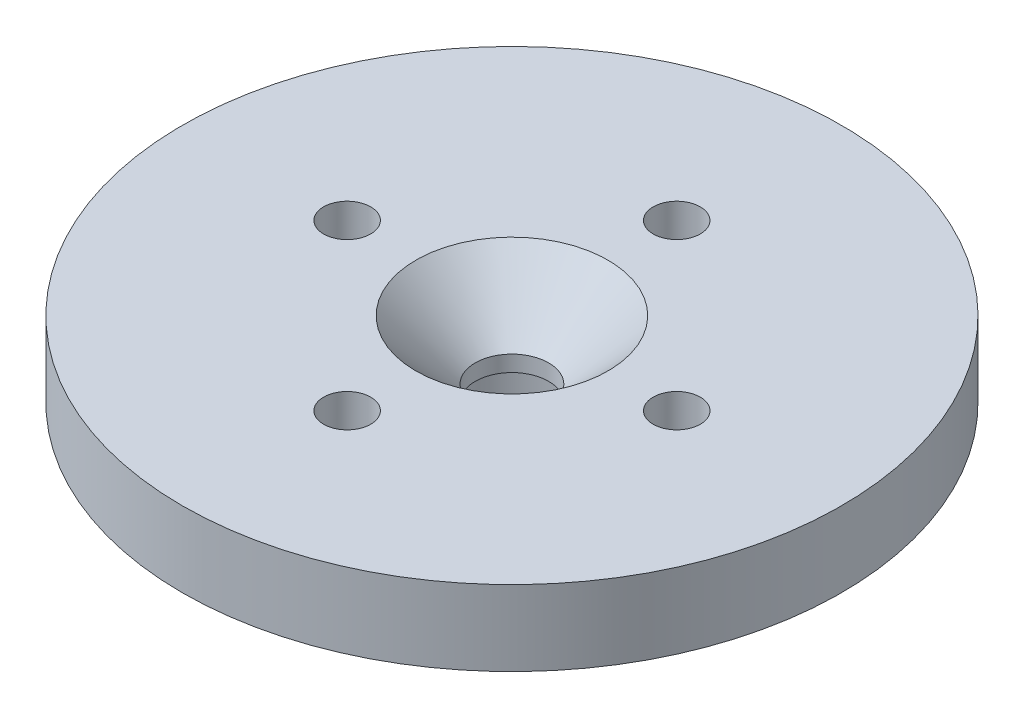
ISO-10303-21;
HEADER;
FILE_DESCRIPTION(('STEP AP214'),'2;1');
FILE_NAME('part.step','',(''),(''),'','','');
FILE_SCHEMA(('AUTOMOTIVE_DESIGN { 1 0 10303 214 1 1 1 1 }'));
ENDSEC;
DATA;
#1=APPLICATION_CONTEXT('core data for automotive mechanical design processes');
#2=APPLICATION_PROTOCOL_DEFINITION('international standard','automotive_design',2000,#1);
#3=PRODUCT_CONTEXT('',#1,'mechanical');
#4=PRODUCT('Part','Part','',(#3));
#5=PRODUCT_RELATED_PRODUCT_CATEGORY('part','',(#4));
#6=PRODUCT_DEFINITION_FORMATION('','',#4);
#7=PRODUCT_DEFINITION_CONTEXT('part definition',#1,'design');
#8=PRODUCT_DEFINITION('design','',#6,#7);
#9=PRODUCT_DEFINITION_SHAPE('','',#8);
#10=(LENGTH_UNIT() NAMED_UNIT(*) SI_UNIT(.MILLI.,.METRE.));
#11=(NAMED_UNIT(*) PLANE_ANGLE_UNIT() SI_UNIT($,.RADIAN.));
#12=(NAMED_UNIT(*) SI_UNIT($,.STERADIAN.) SOLID_ANGLE_UNIT());
#13=UNCERTAINTY_MEASURE_WITH_UNIT(LENGTH_MEASURE(1.E-05),#10,'distance_accuracy_value','');
#14=(GEOMETRIC_REPRESENTATION_CONTEXT(3) GLOBAL_UNCERTAINTY_ASSIGNED_CONTEXT((#13)) GLOBAL_UNIT_ASSIGNED_CONTEXT((#10,
#11,#12)) REPRESENTATION_CONTEXT('',''));
#15=CARTESIAN_POINT('',(0.,0.,0.));
#16=DIRECTION('',(0.,0.,1.));
#17=DIRECTION('',(1.,0.,0.));
#18=AXIS2_PLACEMENT_3D('',#15,#16,#17);
#19=CARTESIAN_POINT('',(0.,0.,0.));
#20=DIRECTION('',(0.,1.,0.));
#21=DIRECTION('',(0.,0.,1.));
#22=AXIS2_PLACEMENT_3D('',#19,#20,#21);
#23=PLANE('',#22);
#24=CARTESIAN_POINT('',(0.,0.,-8.75));
#25=DIRECTION('',(0.,-1.,0.));
#26=DIRECTION('',(0.,0.,-1.));
#27=AXIS2_PLACEMENT_3D('',#24,#25,#26);
#28=CIRCLE('',#27,1.25);
#29=CARTESIAN_POINT('',(0.,0.,-10.));
#30=VERTEX_POINT('',#29);
#31=EDGE_CURVE('E74',#30,#30,#28,.T.);
#32=ORIENTED_EDGE('',*,*,#31,.F.);
#33=EDGE_LOOP('',(#32));
#34=FACE_BOUND('',#33,.T.);
#35=CARTESIAN_POINT('',(0.,0.,8.75));
#36=DIRECTION('',(0.,-1.,0.));
#37=DIRECTION('',(0.,0.,-1.));
#38=AXIS2_PLACEMENT_3D('',#35,#36,#37);
#39=CIRCLE('',#38,1.25);
#40=CARTESIAN_POINT('',(0.,0.,7.5));
#41=VERTEX_POINT('',#40);
#42=EDGE_CURVE('E64',#41,#41,#39,.T.);
#43=ORIENTED_EDGE('',*,*,#42,.F.);
#44=EDGE_LOOP('',(#43));
#45=FACE_BOUND('',#44,.T.);
#46=CARTESIAN_POINT('',(8.75,0.,0.));
#47=DIRECTION('',(0.,-1.,0.));
#48=DIRECTION('',(0.,0.,-1.));
#49=AXIS2_PLACEMENT_3D('',#46,#47,#48);
#50=CIRCLE('',#49,1.25);
#51=CARTESIAN_POINT('',(8.75,0.,-1.25));
#52=VERTEX_POINT('',#51);
#53=EDGE_CURVE('E57',#52,#52,#50,.T.);
#54=ORIENTED_EDGE('',*,*,#53,.F.);
#55=EDGE_LOOP('',(#54));
#56=FACE_BOUND('',#55,.T.);
#57=CARTESIAN_POINT('',(-8.75,0.,0.));
#58=DIRECTION('',(0.,-1.,0.));
#59=DIRECTION('',(0.,0.,-1.));
#60=AXIS2_PLACEMENT_3D('',#57,#58,#59);
#61=CIRCLE('',#60,1.25);
#62=CARTESIAN_POINT('',(-8.75,0.,-1.25));
#63=VERTEX_POINT('',#62);
#64=EDGE_CURVE('E53',#63,#63,#61,.T.);
#65=ORIENTED_EDGE('',*,*,#64,.F.);
#66=EDGE_LOOP('',(#65));
#67=FACE_BOUND('',#66,.T.);
#68=CARTESIAN_POINT('',(0.,0.,0.));
#69=DIRECTION('',(0.,1.,0.));
#70=DIRECTION('',(0.,0.,1.));
#71=AXIS2_PLACEMENT_3D('',#68,#69,#70);
#72=CIRCLE('',#71,17.5);
#73=CARTESIAN_POINT('',(0.,0.,17.5));
#74=VERTEX_POINT('',#73);
#75=EDGE_CURVE('E45',#74,#74,#72,.T.);
#76=ORIENTED_EDGE('',*,*,#75,.F.);
#77=EDGE_LOOP('',(#76));
#78=FACE_BOUND('',#77,.T.);
#79=CARTESIAN_POINT('',(0.,0.,0.));
#80=DIRECTION('',(0.,1.,0.));
#81=DIRECTION('',(0.,0.,1.));
#82=AXIS2_PLACEMENT_3D('',#79,#80,#81);
#83=CIRCLE('',#82,5.);
#84=CARTESIAN_POINT('',(0.,0.,5.));
#85=VERTEX_POINT('',#84);
#86=EDGE_CURVE('E10',#85,#85,#83,.F.);
#87=ORIENTED_EDGE('',*,*,#86,.F.);
#88=EDGE_LOOP('',(#87));
#89=FACE_BOUND('',#88,.T.);
#90=ADVANCED_FACE('F32',(#34,#45,#56,#67,#78,#89),#23,.F.);
#91=CARTESIAN_POINT('',(0.,4.,0.));
#92=DIRECTION('',(0.,-1.,0.));
#93=DIRECTION('',(0.,0.,-1.));
#94=AXIS2_PLACEMENT_3D('',#91,#92,#93);
#95=CYLINDRICAL_SURFACE('',#94,17.5);
#96=CARTESIAN_POINT('',(0.,4.,0.));
#97=DIRECTION('',(0.,1.,0.));
#98=DIRECTION('',(0.,0.,1.));
#99=AXIS2_PLACEMENT_3D('',#96,#97,#98);
#100=CIRCLE('',#99,17.5);
#101=CARTESIAN_POINT('',(0.,4.,17.5));
#102=VERTEX_POINT('',#101);
#103=EDGE_CURVE('E40',#102,#102,#100,.T.);
#104=ORIENTED_EDGE('',*,*,#103,.F.);
#105=EDGE_LOOP('',(#104));
#106=FACE_BOUND('',#105,.T.);
#107=ORIENTED_EDGE('',*,*,#75,.T.);
#108=EDGE_LOOP('',(#107));
#109=FACE_BOUND('',#108,.T.);
#110=ADVANCED_FACE('F34',(#106,#109),#95,.T.);
#111=CARTESIAN_POINT('',(0.,4.,0.));
#112=DIRECTION('',(0.,1.,0.));
#113=DIRECTION('',(0.,0.,1.));
#114=AXIS2_PLACEMENT_3D('',#111,#112,#113);
#115=PLANE('',#114);
#116=CARTESIAN_POINT('',(0.,4.,-8.75));
#117=DIRECTION('',(0.,1.,0.));
#118=DIRECTION('',(0.,0.,1.));
#119=AXIS2_PLACEMENT_3D('',#116,#117,#118);
#120=CIRCLE('',#119,1.25);
#121=CARTESIAN_POINT('',(0.,4.,-7.5));
#122=VERTEX_POINT('',#121);
#123=EDGE_CURVE('E36',#122,#122,#120,.T.);
#124=ORIENTED_EDGE('',*,*,#123,.F.);
#125=EDGE_LOOP('',(#124));
#126=FACE_BOUND('',#125,.T.);
#127=CARTESIAN_POINT('',(0.,4.,8.75));
#128=DIRECTION('',(0.,1.,0.));
#129=DIRECTION('',(0.,0.,1.));
#130=AXIS2_PLACEMENT_3D('',#127,#128,#129);
#131=CIRCLE('',#130,1.25);
#132=CARTESIAN_POINT('',(0.,4.,10.));
#133=VERTEX_POINT('',#132);
#134=EDGE_CURVE('E61',#133,#133,#131,.T.);
#135=ORIENTED_EDGE('',*,*,#134,.F.);
#136=EDGE_LOOP('',(#135));
#137=FACE_BOUND('',#136,.T.);
#138=CARTESIAN_POINT('',(0.,4.,0.));
#139=DIRECTION('',(0.,1.,0.));
#140=DIRECTION('',(0.,0.,1.));
#141=AXIS2_PLACEMENT_3D('',#138,#139,#140);
#142=CIRCLE('',#141,5.1);
#143=CARTESIAN_POINT('',(0.,4.,5.1));
#144=VERTEX_POINT('',#143);
#145=EDGE_CURVE('E63',#144,#144,#142,.T.);
#146=ORIENTED_EDGE('',*,*,#145,.F.);
#147=EDGE_LOOP('',(#146));
#148=FACE_BOUND('',#147,.T.);
#149=CARTESIAN_POINT('',(8.75,4.,0.));
#150=DIRECTION('',(0.,1.,0.));
#151=DIRECTION('',(0.,0.,1.));
#152=AXIS2_PLACEMENT_3D('',#149,#150,#151);
#153=CIRCLE('',#152,1.25);
#154=CARTESIAN_POINT('',(8.75,4.,1.25));
#155=VERTEX_POINT('',#154);
#156=EDGE_CURVE('E54',#155,#155,#153,.T.);
#157=ORIENTED_EDGE('',*,*,#156,.F.);
#158=EDGE_LOOP('',(#157));
#159=FACE_BOUND('',#158,.T.);
#160=CARTESIAN_POINT('',(-8.75,4.,0.));
#161=DIRECTION('',(0.,1.,0.));
#162=DIRECTION('',(0.,0.,1.));
#163=AXIS2_PLACEMENT_3D('',#160,#161,#162);
#164=CIRCLE('',#163,1.25);
#165=CARTESIAN_POINT('',(-8.75,4.,1.25));
#166=VERTEX_POINT('',#165);
#167=EDGE_CURVE('E49',#166,#166,#164,.T.);
#168=ORIENTED_EDGE('',*,*,#167,.F.);
#169=EDGE_LOOP('',(#168));
#170=FACE_BOUND('',#169,.T.);
#171=ORIENTED_EDGE('',*,*,#103,.T.);
#172=EDGE_LOOP('',(#171));
#173=FACE_BOUND('',#172,.T.);
#174=ADVANCED_FACE('F103',(#126,#137,#148,#159,#170,#173),#115,.T.);
#175=CARTESIAN_POINT('',(0.,-6.9,0.));
#176=DIRECTION('',(0.,-1.,0.));
#177=DIRECTION('',(0.,0.,-1.));
#178=AXIS2_PLACEMENT_3D('',#175,#176,#177);
#179=PLANE('',#178);
#180=CARTESIAN_POINT('',(0.,-6.9,0.));
#181=DIRECTION('',(0.,-1.,0.));
#182=DIRECTION('',(0.,0.,-1.));
#183=AXIS2_PLACEMENT_3D('',#180,#181,#182);
#184=CIRCLE('',#183,5.);
#185=CARTESIAN_POINT('',(0.,-6.9,-5.));
#186=VERTEX_POINT('',#185);
#187=EDGE_CURVE('E86',#186,#186,#184,.T.);
#188=ORIENTED_EDGE('',*,*,#187,.T.);
#189=EDGE_LOOP('',(#188));
#190=FACE_BOUND('',#189,.T.);
#191=CARTESIAN_POINT('',(0.,-6.9,0.));
#192=DIRECTION('',(0.,-1.,0.));
#193=DIRECTION('',(0.,0.,-1.));
#194=AXIS2_PLACEMENT_3D('',#191,#192,#193);
#195=CIRCLE('',#194,4.);
#196=CARTESIAN_POINT('',(0.,-6.9,-4.));
#197=VERTEX_POINT('',#196);
#198=EDGE_CURVE('E83',#197,#197,#195,.T.);
#199=ORIENTED_EDGE('',*,*,#198,.F.);
#200=EDGE_LOOP('',(#199));
#201=FACE_BOUND('',#200,.T.);
#202=ADVANCED_FACE('F143',(#190,#201),#179,.T.);
#203=CARTESIAN_POINT('',(0.,-6.9,0.));
#204=DIRECTION('',(0.,1.,0.));
#205=DIRECTION('',(0.,0.,1.));
#206=AXIS2_PLACEMENT_3D('',#203,#204,#205);
#207=CYLINDRICAL_SURFACE('',#206,5.);
#208=ORIENTED_EDGE('',*,*,#187,.F.);
#209=EDGE_LOOP('',(#208));
#210=FACE_BOUND('',#209,.T.);
#211=ORIENTED_EDGE('',*,*,#86,.T.);
#212=EDGE_LOOP('',(#211));
#213=FACE_BOUND('',#212,.T.);
#214=ADVANCED_FACE('F119',(#210,#213),#207,.T.);
#215=CARTESIAN_POINT('',(0.,-6.9,0.));
#216=DIRECTION('',(0.,1.,0.));
#217=DIRECTION('',(0.,0.,1.));
#218=AXIS2_PLACEMENT_3D('',#215,#216,#217);
#219=CYLINDRICAL_SURFACE('',#218,4.);
#220=ORIENTED_EDGE('',*,*,#198,.T.);
#221=EDGE_LOOP('',(#220));
#222=FACE_BOUND('',#221,.T.);
#223=CARTESIAN_POINT('',(0.,0.,0.));
#224=DIRECTION('',(0.,-1.,0.));
#225=DIRECTION('',(0.,0.,-1.));
#226=AXIS2_PLACEMENT_3D('',#223,#224,#225);
#227=CIRCLE('',#226,4.);
#228=CARTESIAN_POINT('',(0.,0.,-4.));
#229=VERTEX_POINT('',#228);
#230=EDGE_CURVE('E52',#229,#229,#227,.T.);
#231=ORIENTED_EDGE('',*,*,#230,.F.);
#232=EDGE_LOOP('',(#231));
#233=FACE_BOUND('',#232,.T.);
#234=ADVANCED_FACE('F110',(#222,#233),#219,.F.);
#235=CARTESIAN_POINT('',(0.,0.,0.));
#236=DIRECTION('',(0.,1.,0.));
#237=DIRECTION('',(0.,0.,1.));
#238=AXIS2_PLACEMENT_3D('',#235,#236,#237);
#239=CIRCLE('',#238,1.95);
#240=CARTESIAN_POINT('',(0.,0.,1.95));
#241=VERTEX_POINT('',#240);
#242=EDGE_CURVE('E58',#241,#241,#239,.T.);
#243=ORIENTED_EDGE('',*,*,#242,.T.);
#244=EDGE_LOOP('',(#243));
#245=FACE_BOUND('',#244,.T.);
#246=ORIENTED_EDGE('',*,*,#230,.T.);
#247=EDGE_LOOP('',(#246));
#248=FACE_BOUND('',#247,.T.);
#249=ADVANCED_FACE('F99',(#245,#248),#23,.F.);
#250=CARTESIAN_POINT('',(-8.75,6.9,0.));
#251=DIRECTION('',(0.,-1.,0.));
#252=DIRECTION('',(0.,0.,-1.));
#253=AXIS2_PLACEMENT_3D('',#250,#251,#252);
#254=CYLINDRICAL_SURFACE('',#253,1.25);
#255=ORIENTED_EDGE('',*,*,#167,.T.);
#256=EDGE_LOOP('',(#255));
#257=FACE_BOUND('',#256,.T.);
#258=ORIENTED_EDGE('',*,*,#64,.T.);
#259=EDGE_LOOP('',(#258));
#260=FACE_BOUND('',#259,.T.);
#261=ADVANCED_FACE('F109',(#257,#260),#254,.F.);
#262=CARTESIAN_POINT('',(8.75,6.9,0.));
#263=DIRECTION('',(0.,-1.,0.));
#264=DIRECTION('',(0.,0.,-1.));
#265=AXIS2_PLACEMENT_3D('',#262,#263,#264);
#266=CYLINDRICAL_SURFACE('',#265,1.25);
#267=ORIENTED_EDGE('',*,*,#156,.T.);
#268=EDGE_LOOP('',(#267));
#269=FACE_BOUND('',#268,.T.);
#270=ORIENTED_EDGE('',*,*,#53,.T.);
#271=EDGE_LOOP('',(#270));
#272=FACE_BOUND('',#271,.T.);
#273=ADVANCED_FACE('F116',(#269,#272),#266,.F.);
#274=CARTESIAN_POINT('',(0.,4.,0.));
#275=DIRECTION('',(0.,1.,0.));
#276=DIRECTION('',(0.,0.,1.));
#277=AXIS2_PLACEMENT_3D('',#274,#275,#276);
#278=CYLINDRICAL_SURFACE('',#277,1.95);
#279=CARTESIAN_POINT('',(0.,0.85,0.));
#280=DIRECTION('',(0.,1.,0.));
#281=DIRECTION('',(0.,0.,1.));
#282=AXIS2_PLACEMENT_3D('',#279,#280,#281);
#283=CIRCLE('',#282,1.95);
#284=CARTESIAN_POINT('',(0.,0.85,1.95));
#285=VERTEX_POINT('',#284);
#286=EDGE_CURVE('E60',#285,#285,#283,.T.);
#287=ORIENTED_EDGE('',*,*,#286,.T.);
#288=EDGE_LOOP('',(#287));
#289=FACE_BOUND('',#288,.T.);
#290=ORIENTED_EDGE('',*,*,#242,.F.);
#291=EDGE_LOOP('',(#290));
#292=FACE_BOUND('',#291,.T.);
#293=ADVANCED_FACE('F127',(#289,#292),#278,.F.);
#294=CARTESIAN_POINT('',(0.,4.,0.));
#295=DIRECTION('',(0.,1.,0.));
#296=DIRECTION('',(0.,0.,1.));
#297=AXIS2_PLACEMENT_3D('',#294,#295,#296);
#298=CONICAL_SURFACE('',#297,5.1,0.785398163397449);
#299=ORIENTED_EDGE('',*,*,#286,.F.);
#300=EDGE_LOOP('',(#299));
#301=FACE_BOUND('',#300,.T.);
#302=ORIENTED_EDGE('',*,*,#145,.T.);
#303=EDGE_LOOP('',(#302));
#304=FACE_BOUND('',#303,.T.);
#305=ADVANCED_FACE('F129',(#301,#304),#298,.F.);
#306=CARTESIAN_POINT('',(0.,6.9,8.75));
#307=DIRECTION('',(0.,-1.,0.));
#308=DIRECTION('',(0.,0.,-1.));
#309=AXIS2_PLACEMENT_3D('',#306,#307,#308);
#310=CYLINDRICAL_SURFACE('',#309,1.25);
#311=ORIENTED_EDGE('',*,*,#134,.T.);
#312=EDGE_LOOP('',(#311));
#313=FACE_BOUND('',#312,.T.);
#314=ORIENTED_EDGE('',*,*,#42,.T.);
#315=EDGE_LOOP('',(#314));
#316=FACE_BOUND('',#315,.T.);
#317=ADVANCED_FACE('F136',(#313,#316),#310,.F.);
#318=CARTESIAN_POINT('',(0.,6.9,-8.75));
#319=DIRECTION('',(0.,-1.,0.));
#320=DIRECTION('',(0.,0.,-1.));
#321=AXIS2_PLACEMENT_3D('',#318,#319,#320);
#322=CYLINDRICAL_SURFACE('',#321,1.25);
#323=ORIENTED_EDGE('',*,*,#123,.T.);
#324=EDGE_LOOP('',(#323));
#325=FACE_BOUND('',#324,.T.);
#326=ORIENTED_EDGE('',*,*,#31,.T.);
#327=EDGE_LOOP('',(#326));
#328=FACE_BOUND('',#327,.T.);
#329=ADVANCED_FACE('F170',(#325,#328),#322,.F.);
#330=CLOSED_SHELL('',(#90,#110,#174,#202,#214,#234,#249,#261,#273,#293,#305,#317,#329));
#331=MANIFOLD_SOLID_BREP('B2',#330);
#332=ADVANCED_BREP_SHAPE_REPRESENTATION('',(#18,#331),#14);
#333=SHAPE_DEFINITION_REPRESENTATION(#9,#332);
ENDSEC;
END-ISO-10303-21;
